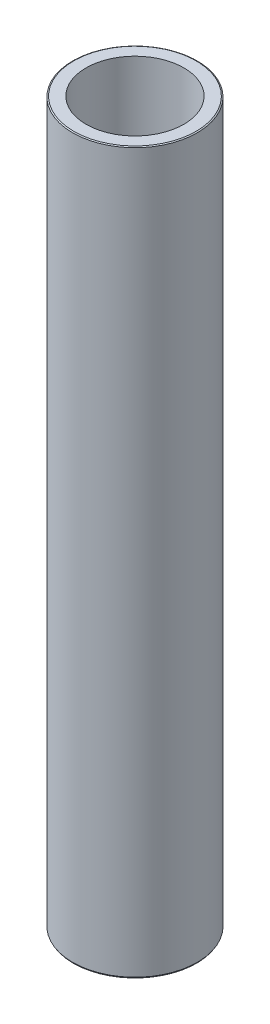
ISO-10303-21;
HEADER;
FILE_DESCRIPTION(('STEP AP214'),'2;1');
FILE_NAME('part.step','',(''),(''),'','','');
FILE_SCHEMA(('AUTOMOTIVE_DESIGN { 1 0 10303 214 1 1 1 1 }'));
ENDSEC;
DATA;
#1=APPLICATION_CONTEXT('core data for automotive mechanical design processes');
#2=APPLICATION_PROTOCOL_DEFINITION('international standard','automotive_design',2000,#1);
#3=PRODUCT_CONTEXT('',#1,'mechanical');
#4=PRODUCT('Part','Part','',(#3));
#5=PRODUCT_RELATED_PRODUCT_CATEGORY('part','',(#4));
#6=PRODUCT_DEFINITION_FORMATION('','',#4);
#7=PRODUCT_DEFINITION_CONTEXT('part definition',#1,'design');
#8=PRODUCT_DEFINITION('design','',#6,#7);
#9=PRODUCT_DEFINITION_SHAPE('','',#8);
#10=(LENGTH_UNIT() NAMED_UNIT(*) SI_UNIT(.MILLI.,.METRE.));
#11=(NAMED_UNIT(*) PLANE_ANGLE_UNIT() SI_UNIT($,.RADIAN.));
#12=(NAMED_UNIT(*) SI_UNIT($,.STERADIAN.) SOLID_ANGLE_UNIT());
#13=UNCERTAINTY_MEASURE_WITH_UNIT(LENGTH_MEASURE(1.E-05),#10,'distance_accuracy_value','');
#14=(GEOMETRIC_REPRESENTATION_CONTEXT(3) GLOBAL_UNCERTAINTY_ASSIGNED_CONTEXT((#13)) GLOBAL_UNIT_ASSIGNED_CONTEXT((#10,
#11,#12)) REPRESENTATION_CONTEXT('',''));
#15=CARTESIAN_POINT('',(0.,0.,0.));
#16=DIRECTION('',(0.,0.,1.));
#17=DIRECTION('',(1.,0.,0.));
#18=AXIS2_PLACEMENT_3D('',#15,#16,#17);
#19=CARTESIAN_POINT('',(0.,491.346406298745,0.));
#20=DIRECTION('',(0.,-1.,0.));
#21=DIRECTION('',(0.,0.,-1.));
#22=AXIS2_PLACEMENT_3D('',#19,#20,#21);
#23=CYLINDRICAL_SURFACE('',#22,42.5);
#24=CARTESIAN_POINT('',(0.,490.884382485097,0.));
#25=DIRECTION('',(0.,1.,0.));
#26=DIRECTION('',(0.,0.,1.));
#27=AXIS2_PLACEMENT_3D('',#24,#25,#26);
#28=CIRCLE('',#27,42.5);
#29=CARTESIAN_POINT('',(0.,490.884382485097,42.5));
#30=VERTEX_POINT('',#29);
#31=EDGE_CURVE('E50',#30,#30,#28,.F.);
#32=ORIENTED_EDGE('',*,*,#31,.T.);
#33=EDGE_LOOP('',(#32));
#34=FACE_BOUND('',#33,.T.);
#35=CARTESIAN_POINT('',(0.,0.800248719545482,0.));
#36=DIRECTION('',(0.,1.,0.));
#37=DIRECTION('',(0.,0.,1.));
#38=AXIS2_PLACEMENT_3D('',#35,#36,#37);
#39=CIRCLE('',#38,42.5);
#40=CARTESIAN_POINT('',(0.,0.800248719545482,42.5));
#41=VERTEX_POINT('',#40);
#42=EDGE_CURVE('E51',#41,#41,#39,.T.);
#43=ORIENTED_EDGE('',*,*,#42,.T.);
#44=EDGE_LOOP('',(#43));
#45=FACE_BOUND('',#44,.T.);
#46=ADVANCED_FACE('F39',(#34,#45),#23,.T.);
#47=CARTESIAN_POINT('',(0.,491.346406298745,0.));
#48=DIRECTION('',(0.,1.,0.));
#49=DIRECTION('',(0.,0.,1.));
#50=AXIS2_PLACEMENT_3D('',#47,#48,#49);
#51=PLANE('',#50);
#52=CARTESIAN_POINT('',(0.,491.346406298745,0.));
#53=DIRECTION('',(0.,1.,0.));
#54=DIRECTION('',(0.,0.,1.));
#55=AXIS2_PLACEMENT_3D('',#52,#53,#54);
#56=CIRCLE('',#55,41.6997512804543);
#57=CARTESIAN_POINT('',(0.,491.346406298745,41.6997512804543));
#58=VERTEX_POINT('',#57);
#59=EDGE_CURVE('E54',#58,#58,#56,.T.);
#60=ORIENTED_EDGE('',*,*,#59,.T.);
#61=EDGE_LOOP('',(#60));
#62=FACE_BOUND('',#61,.T.);
#63=CARTESIAN_POINT('',(0.,491.346406298745,0.));
#64=DIRECTION('',(0.,1.,0.));
#65=DIRECTION('',(0.,0.,1.));
#66=AXIS2_PLACEMENT_3D('',#63,#64,#65);
#67=CIRCLE('',#66,33.3692104787715);
#68=CARTESIAN_POINT('',(0.,491.346406298745,33.3692104787715));
#69=VERTEX_POINT('',#68);
#70=EDGE_CURVE('E58',#69,#69,#67,.T.);
#71=ORIENTED_EDGE('',*,*,#70,.F.);
#72=EDGE_LOOP('',(#71));
#73=FACE_BOUND('',#72,.T.);
#74=ADVANCED_FACE('F69',(#62,#73),#51,.T.);
#75=CARTESIAN_POINT('',(0.,0.,0.));
#76=DIRECTION('',(0.,1.,0.));
#77=DIRECTION('',(0.,0.,1.));
#78=AXIS2_PLACEMENT_3D('',#75,#76,#77);
#79=PLANE('',#78);
#80=CARTESIAN_POINT('',(0.,0.,0.));
#81=DIRECTION('',(0.,1.,0.));
#82=DIRECTION('',(0.,0.,1.));
#83=AXIS2_PLACEMENT_3D('',#80,#81,#82);
#84=CIRCLE('',#83,42.0379761863518);
#85=CARTESIAN_POINT('',(0.,0.,42.0379761863518));
#86=VERTEX_POINT('',#85);
#87=EDGE_CURVE('E10',#86,#86,#84,.F.);
#88=ORIENTED_EDGE('',*,*,#87,.T.);
#89=EDGE_LOOP('',(#88));
#90=FACE_BOUND('',#89,.T.);
#91=CARTESIAN_POINT('',(0.,0.,0.));
#92=DIRECTION('',(0.,1.,0.));
#93=DIRECTION('',(0.,0.,1.));
#94=AXIS2_PLACEMENT_3D('',#91,#92,#93);
#95=CIRCLE('',#94,33.3692104787715);
#96=CARTESIAN_POINT('',(0.,0.,33.3692104787715));
#97=VERTEX_POINT('',#96);
#98=EDGE_CURVE('E63',#97,#97,#95,.T.);
#99=ORIENTED_EDGE('',*,*,#98,.T.);
#100=EDGE_LOOP('',(#99));
#101=FACE_BOUND('',#100,.T.);
#102=ADVANCED_FACE('F75',(#90,#101),#79,.F.);
#103=CARTESIAN_POINT('',(0.,491.346406298745,0.));
#104=DIRECTION('',(0.,-1.,0.));
#105=DIRECTION('',(0.,0.,-1.));
#106=AXIS2_PLACEMENT_3D('',#103,#104,#105);
#107=CYLINDRICAL_SURFACE('',#106,33.3692104787715);
#108=ORIENTED_EDGE('',*,*,#70,.T.);
#109=EDGE_LOOP('',(#108));
#110=FACE_BOUND('',#109,.T.);
#111=ORIENTED_EDGE('',*,*,#98,.F.);
#112=EDGE_LOOP('',(#111));
#113=FACE_BOUND('',#112,.T.);
#114=ADVANCED_FACE('F70',(#110,#113),#107,.F.);
#115=CARTESIAN_POINT('',(0.,491.346406298745,0.));
#116=DIRECTION('',(0.,-1.,0.));
#117=DIRECTION('',(0.,0.,-1.));
#118=AXIS2_PLACEMENT_3D('',#115,#116,#117);
#119=CONICAL_SURFACE('',#118,41.6997512804543,1.04719755119655);
#120=ORIENTED_EDGE('',*,*,#31,.F.);
#121=EDGE_LOOP('',(#120));
#122=FACE_BOUND('',#121,.T.);
#123=ORIENTED_EDGE('',*,*,#59,.F.);
#124=EDGE_LOOP('',(#123));
#125=FACE_BOUND('',#124,.T.);
#126=ADVANCED_FACE('F81',(#122,#125),#119,.T.);
#127=CARTESIAN_POINT('',(0.,0.800248719545482,0.));
#128=DIRECTION('',(0.,1.,0.));
#129=DIRECTION('',(0.,0.,1.));
#130=AXIS2_PLACEMENT_3D('',#127,#128,#129);
#131=CONICAL_SURFACE('',#130,42.5,0.523598775598299);
#132=CARTESIAN_POINT('',(0.,0.,42.0379761863518));
#133=CARTESIAN_POINT('',(0.,0.00833592416193366,42.0427889344106));
#134=CARTESIAN_POINT('',(0.,0.0166718483238652,42.0476016824694));
#135=CARTESIAN_POINT('',(0.,0.0333436966477282,42.0572271785871));
#136=CARTESIAN_POINT('',(0.,0.0416796208096598,42.062039926646));
#137=CARTESIAN_POINT('',(0.,0.0583514691335243,42.0716654227636));
#138=CARTESIAN_POINT('',(0.,0.0666873932954573,42.0764781708225));
#139=CARTESIAN_POINT('',(0.,0.0833592416193214,42.0861036669401));
#140=CARTESIAN_POINT('',(0.,0.0916951657812525,42.090916414999));
#141=CARTESIAN_POINT('',(0.,0.108367014105117,42.1005419111166));
#142=CARTESIAN_POINT('',(0.,0.11670293826705,42.1053546591755));
#143=CARTESIAN_POINT('',(0.,0.133374786590914,42.1149801552931));
#144=CARTESIAN_POINT('',(0.,0.141710710752845,42.119792903352));
#145=CARTESIAN_POINT('',(0.,0.158382559076709,42.1294183994697));
#146=CARTESIAN_POINT('',(0.,0.166718483238643,42.1342311475285));
#147=CARTESIAN_POINT('',(0.,0.183390331562507,42.1438566436462));
#148=CARTESIAN_POINT('',(0.,0.191726255724438,42.148669391705));
#149=CARTESIAN_POINT('',(0.,0.208398104048302,42.1582948878227));
#150=CARTESIAN_POINT('',(0.,0.216734028210235,42.1631076358815));
#151=CARTESIAN_POINT('',(0.,0.233405876534099,42.1727331319992));
#152=CARTESIAN_POINT('',(0.,0.24174180069603,42.177545880058));
#153=CARTESIAN_POINT('',(0.,0.258413649019895,42.1871713761757));
#154=CARTESIAN_POINT('',(0.,0.266749573181828,42.1919841242345));
#155=CARTESIAN_POINT('',(0.,0.283421421505692,42.2016096203522));
#156=CARTESIAN_POINT('',(0.,0.291757345667623,42.206422368411));
#157=CARTESIAN_POINT('',(0.,0.308429193991487,42.2160478645287));
#158=CARTESIAN_POINT('',(0.,0.31676511815342,42.2208606125875));
#159=CARTESIAN_POINT('',(0.,0.333436966477285,42.2304861087052));
#160=CARTESIAN_POINT('',(0.,0.341772890639216,42.235298856764));
#161=CARTESIAN_POINT('',(0.,0.35844473896308,42.2449243528817));
#162=CARTESIAN_POINT('',(0.,0.366780663125013,42.2497371009405));
#163=CARTESIAN_POINT('',(0.,0.383452511448877,42.2593625970582));
#164=CARTESIAN_POINT('',(0.,0.391788435610808,42.2641753451171));
#165=CARTESIAN_POINT('',(0.,0.408460283934673,42.2738008412347));
#166=CARTESIAN_POINT('',(0.,0.416796208096606,42.2786135892936));
#167=CARTESIAN_POINT('',(0.,0.43346805642047,42.2882390854112));
#168=CARTESIAN_POINT('',(0.,0.441803980582401,42.2930518334701));
#169=CARTESIAN_POINT('',(0.,0.458475828906265,42.3026773295877));
#170=CARTESIAN_POINT('',(0.,0.466811753068198,42.3074900776466));
#171=CARTESIAN_POINT('',(0.,0.483483601392063,42.3171155737642));
#172=CARTESIAN_POINT('',(0.,0.491819525553994,42.3219283218231));
#173=CARTESIAN_POINT('',(0.,0.508491373877858,42.3315538179408));
#174=CARTESIAN_POINT('',(0.,0.516827298039791,42.3363665659996));
#175=CARTESIAN_POINT('',(0.,0.533499146363655,42.3459920621173));
#176=CARTESIAN_POINT('',(0.,0.541835070525586,42.3508048101761));
#177=CARTESIAN_POINT('',(0.,0.558506918849451,42.3604303062938));
#178=CARTESIAN_POINT('',(0.,0.566842843011384,42.3652430543526));
#179=CARTESIAN_POINT('',(0.,0.583514691335248,42.3748685504703));
#180=CARTESIAN_POINT('',(0.,0.591850615497179,42.3796812985291));
#181=CARTESIAN_POINT('',(0.,0.608522463821043,42.3893067946468));
#182=CARTESIAN_POINT('',(0.,0.616858387982976,42.3941195427056));
#183=CARTESIAN_POINT('',(0.,0.63353023630684,42.4037450388233));
#184=CARTESIAN_POINT('',(0.,0.641866160468772,42.4085577868821));
#185=CARTESIAN_POINT('',(0.,0.658538008792636,42.4181832829998));
#186=CARTESIAN_POINT('',(0.,0.666873932954569,42.4229960310586));
#187=CARTESIAN_POINT('',(0.,0.683545781278433,42.4326215271763));
#188=CARTESIAN_POINT('',(0.,0.691881705440364,42.4374342752351));
#189=CARTESIAN_POINT('',(0.,0.708553553764228,42.4470597713528));
#190=CARTESIAN_POINT('',(0.,0.716889477926162,42.4518725194116));
#191=CARTESIAN_POINT('',(0.,0.733561326250026,42.4614980155293));
#192=CARTESIAN_POINT('',(0.,0.741897250411957,42.4663107635882));
#193=CARTESIAN_POINT('',(0.,0.758569098735821,42.4759362597058));
#194=CARTESIAN_POINT('',(0.,0.766905022897754,42.4807490077647));
#195=CARTESIAN_POINT('',(0.,0.783576871221619,42.4903745038823));
#196=CARTESIAN_POINT('',(0.,0.791912795383552,42.4951872519412));
#197=CARTESIAN_POINT('',(0.,0.800248719545482,42.5));
#198=B_SPLINE_CURVE_WITH_KNOTS('',3,(#132,#133,#134,#135,#136,#137,#138,#139,#140,#141,#142,
#143,#144,#145,#146,#147,#148,#149,#150,#151,#152,#153,#154,#155,#156,#157,#158,#159,#160,#161,
#162,#163,#164,#165,#166,#167,#168,#169,#170,#171,#172,#173,#174,#175,#176,#177,#178,#179,#180,
#181,#182,#183,#184,#185,#186,#187,#188,#189,#190,#191,#192,#193,#194,#195,#196,#197),
.UNSPECIFIED.,.F.,.F.,(4,2,2,2,2,2,2,2,2,2,2,2,2,2,2,2,2,2,2,2,2,2,2,2,2,2,2,2,2,2,2,2,4),(0.,
0.0288764883530131,0.0577529767060297,0.0866294650590428,0.115505953412059,0.144382441765073,
0.173258930118089,0.202135418471102,0.231011906824119,0.259888395177132,0.288764883530149,
0.317641371883162,0.346517860236178,0.375394348589191,0.404270836942208,0.433147325295221,
0.462023813648238,0.490900302001251,0.519776790354267,0.548653278707281,0.577529767060297,
0.606406255413311,0.635282743766327,0.66415923211934,0.693035720472357,0.72191220882537,
0.750788697178386,0.7796651855314,0.808541673884416,0.837418162237429,0.866294650590446,
0.895171138943459,0.924047627296476),.UNSPECIFIED.);
#199=EDGE_CURVE('BSEAM45',#86,#41,#198,.T.);
#200=ORIENTED_EDGE('',*,*,#87,.F.);
#201=ORIENTED_EDGE('',*,*,#42,.F.);
#202=ORIENTED_EDGE('',*,*,#199,.T.);
#203=ORIENTED_EDGE('',*,*,#199,.F.);
#204=EDGE_LOOP('',(#200,#202,#201,#203));
#205=FACE_BOUND('',#204,.T.);
#206=ADVANCED_FACE('F45',(#205),#131,.T.);
#207=CLOSED_SHELL('',(#46,#74,#102,#114,#126,#206));
#208=MANIFOLD_SOLID_BREP('B2',#207);
#209=ADVANCED_BREP_SHAPE_REPRESENTATION('',(#18,#208),#14);
#210=SHAPE_DEFINITION_REPRESENTATION(#9,#209);
ENDSEC;
END-ISO-10303-21;
